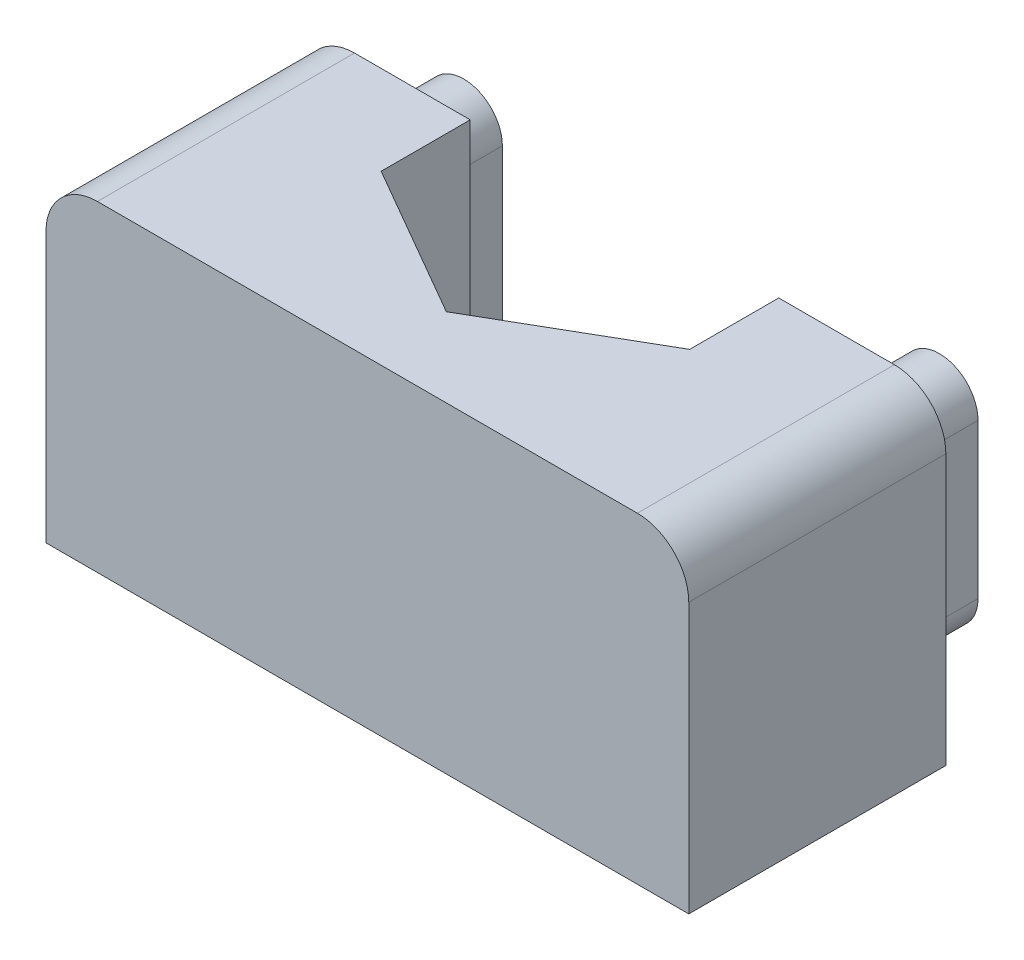
ISO-10303-21;
HEADER;
FILE_DESCRIPTION(('STEP AP214'),'2;1');
FILE_NAME('part.step','',(''),(''),'','','');
FILE_SCHEMA(('AUTOMOTIVE_DESIGN { 1 0 10303 214 1 1 1 1 }'));
ENDSEC;
DATA;
#1=APPLICATION_CONTEXT('core data for automotive mechanical design processes');
#2=APPLICATION_PROTOCOL_DEFINITION('international standard','automotive_design',2000,#1);
#3=PRODUCT_CONTEXT('',#1,'mechanical');
#4=PRODUCT('Part','Part','',(#3));
#5=PRODUCT_RELATED_PRODUCT_CATEGORY('part','',(#4));
#6=PRODUCT_DEFINITION_FORMATION('','',#4);
#7=PRODUCT_DEFINITION_CONTEXT('part definition',#1,'design');
#8=PRODUCT_DEFINITION('design','',#6,#7);
#9=PRODUCT_DEFINITION_SHAPE('','',#8);
#10=(LENGTH_UNIT() NAMED_UNIT(*) SI_UNIT(.MILLI.,.METRE.));
#11=(NAMED_UNIT(*) PLANE_ANGLE_UNIT() SI_UNIT($,.RADIAN.));
#12=(NAMED_UNIT(*) SI_UNIT($,.STERADIAN.) SOLID_ANGLE_UNIT());
#13=UNCERTAINTY_MEASURE_WITH_UNIT(LENGTH_MEASURE(1.E-05),#10,'distance_accuracy_value','');
#14=(GEOMETRIC_REPRESENTATION_CONTEXT(3) GLOBAL_UNCERTAINTY_ASSIGNED_CONTEXT((#13)) GLOBAL_UNIT_ASSIGNED_CONTEXT((#10,
#11,#12)) REPRESENTATION_CONTEXT('',''));
#15=CARTESIAN_POINT('',(0.,0.,0.));
#16=DIRECTION('',(0.,0.,1.));
#17=DIRECTION('',(1.,0.,0.));
#18=AXIS2_PLACEMENT_3D('',#15,#16,#17);
#19=CARTESIAN_POINT('',(-25.,-12.5,-39.));
#20=DIRECTION('',(0.,0.,-1.));
#21=DIRECTION('',(-1.,0.,0.));
#22=AXIS2_PLACEMENT_3D('',#19,#20,#21);
#23=PLANE('',#22);
#24=DIRECTION('',(0.,1.,0.));
#25=VECTOR('',#24,1.);
#26=CARTESIAN_POINT('',(-25.,-12.5,-39.));
#27=LINE('',#26,#25);
#28=CARTESIAN_POINT('',(-25.,-12.5,-39.));
#29=VERTEX_POINT('',#28);
#30=CARTESIAN_POINT('',(-25.,-2.,-39.));
#31=VERTEX_POINT('',#30);
#32=EDGE_CURVE('E300',#29,#31,#27,.T.);
#33=ORIENTED_EDGE('',*,*,#32,.T.);
#34=CARTESIAN_POINT('',(-23.,-2.,-39.));
#35=DIRECTION('',(0.,0.,-1.));
#36=DIRECTION('',(-1.,0.,0.));
#37=AXIS2_PLACEMENT_3D('',#34,#35,#36);
#38=CIRCLE('',#37,2.);
#39=CARTESIAN_POINT('',(-23.,0.,-39.));
#40=VERTEX_POINT('',#39);
#41=EDGE_CURVE('E11',#31,#40,#38,.T.);
#42=ORIENTED_EDGE('',*,*,#41,.T.);
#43=DIRECTION('',(-1.,0.,0.));
#44=VECTOR('',#43,1.);
#45=CARTESIAN_POINT('',(-25.,0.,-39.));
#46=LINE('',#45,#44);
#47=CARTESIAN_POINT('',(-18.5,0.,-39.));
#48=VERTEX_POINT('',#47);
#49=EDGE_CURVE('E298',#48,#40,#46,.T.);
#50=ORIENTED_EDGE('',*,*,#49,.F.);
#51=DIRECTION('',(0.,1.,0.));
#52=VECTOR('',#51,1.);
#53=CARTESIAN_POINT('',(-18.5,-7.5,-39.));
#54=LINE('',#53,#52);
#55=CARTESIAN_POINT('',(-18.5,-7.5,-39.));
#56=VERTEX_POINT('',#55);
#57=EDGE_CURVE('E266',#56,#48,#54,.T.);
#58=ORIENTED_EDGE('',*,*,#57,.F.);
#59=DIRECTION('',(-1.,0.,0.));
#60=VECTOR('',#59,1.);
#61=CARTESIAN_POINT('',(-25.,-7.5,-39.));
#62=LINE('',#61,#60);
#63=CARTESIAN_POINT('',(-17.5,-7.5,-39.));
#64=VERTEX_POINT('',#63);
#65=EDGE_CURVE('E309',#64,#56,#62,.T.);
#66=ORIENTED_EDGE('',*,*,#65,.F.);
#67=DIRECTION('',(0.,1.,0.));
#68=VECTOR('',#67,1.);
#69=CARTESIAN_POINT('',(-17.5,-12.5,-39.));
#70=LINE('',#69,#68);
#71=CARTESIAN_POINT('',(-17.5,-12.5,-39.));
#72=VERTEX_POINT('',#71);
#73=EDGE_CURVE('E250',#72,#64,#70,.T.);
#74=ORIENTED_EDGE('',*,*,#73,.F.);
#75=DIRECTION('',(-1.,0.,0.));
#76=VECTOR('',#75,1.);
#77=CARTESIAN_POINT('',(-25.,-12.5,-39.));
#78=LINE('',#77,#76);
#79=EDGE_CURVE('E290',#72,#29,#78,.T.);
#80=ORIENTED_EDGE('',*,*,#79,.T.);
#81=EDGE_LOOP('',(#33,#42,#50,#58,#66,#74,#80));
#82=FACE_BOUND('',#81,.T.);
#83=DIRECTION('',(0.,-1.,0.));
#84=VECTOR('',#83,1.);
#85=CARTESIAN_POINT('',(-20.25,-3.25,-39.));
#86=LINE('',#85,#84);
#87=CARTESIAN_POINT('',(-20.25,-3.25,-39.));
#88=VERTEX_POINT('',#87);
#89=CARTESIAN_POINT('',(-20.25,-9.25,-39.));
#90=VERTEX_POINT('',#89);
#91=EDGE_CURVE('E608',#88,#90,#86,.T.);
#92=ORIENTED_EDGE('',*,*,#91,.F.);
#93=CARTESIAN_POINT('',(-21.75,-3.25,-39.));
#94=DIRECTION('',(0.,0.,-1.));
#95=DIRECTION('',(1.,0.,0.));
#96=AXIS2_PLACEMENT_3D('',#93,#94,#95);
#97=CIRCLE('',#96,1.5);
#98=CARTESIAN_POINT('',(-23.25,-3.25,-39.));
#99=VERTEX_POINT('',#98);
#100=EDGE_CURVE('E204',#99,#88,#97,.T.);
#101=ORIENTED_EDGE('',*,*,#100,.F.);
#102=DIRECTION('',(0.,1.,0.));
#103=VECTOR('',#102,1.);
#104=CARTESIAN_POINT('',(-23.25,-3.25,-39.));
#105=LINE('',#104,#103);
#106=CARTESIAN_POINT('',(-23.25,-9.25,-39.));
#107=VERTEX_POINT('',#106);
#108=EDGE_CURVE('E200',#107,#99,#105,.T.);
#109=ORIENTED_EDGE('',*,*,#108,.F.);
#110=CARTESIAN_POINT('',(-21.75,-9.25,-39.));
#111=DIRECTION('',(0.,0.,-1.));
#112=DIRECTION('',(1.,0.,0.));
#113=AXIS2_PLACEMENT_3D('',#110,#111,#112);
#114=CIRCLE('',#113,1.5);
#115=EDGE_CURVE('E605',#90,#107,#114,.T.);
#116=ORIENTED_EDGE('',*,*,#115,.F.);
#117=EDGE_LOOP('',(#92,#101,#109,#116));
#118=FACE_BOUND('',#117,.T.);
#119=ADVANCED_FACE('F39',(#82,#118),#23,.T.);
#120=CARTESIAN_POINT('',(-2.00000000000002,0.,-39.));
#121=VERTEX_POINT('',#120);
#122=CARTESIAN_POINT('',(-6.5,0.,-39.));
#123=VERTEX_POINT('',#122);
#124=EDGE_CURVE('E291',#121,#123,#46,.T.);
#125=ORIENTED_EDGE('',*,*,#124,.F.);
#126=CARTESIAN_POINT('',(-2.00000000000001,-2.,-39.));
#127=DIRECTION('',(0.,0.,-1.));
#128=DIRECTION('',(-1.,0.,0.));
#129=AXIS2_PLACEMENT_3D('',#126,#127,#128);
#130=CIRCLE('',#129,2.);
#131=CARTESIAN_POINT('',(0.,-2.,-39.));
#132=VERTEX_POINT('',#131);
#133=EDGE_CURVE('E322',#121,#132,#130,.T.);
#134=ORIENTED_EDGE('',*,*,#133,.T.);
#135=DIRECTION('',(0.,1.,0.));
#136=VECTOR('',#135,1.);
#137=CARTESIAN_POINT('',(0.,-12.5,-39.));
#138=LINE('',#137,#136);
#139=CARTESIAN_POINT('',(0.,-12.5,-39.));
#140=VERTEX_POINT('',#139);
#141=EDGE_CURVE('E303',#140,#132,#138,.T.);
#142=ORIENTED_EDGE('',*,*,#141,.F.);
#143=CARTESIAN_POINT('',(-7.5,-12.5,-39.));
#144=VERTEX_POINT('',#143);
#145=EDGE_CURVE('E292',#140,#144,#78,.T.);
#146=ORIENTED_EDGE('',*,*,#145,.T.);
#147=DIRECTION('',(0.,1.,0.));
#148=VECTOR('',#147,1.);
#149=CARTESIAN_POINT('',(-7.5,-12.5,-39.));
#150=LINE('',#149,#148);
#151=CARTESIAN_POINT('',(-7.5,-7.5,-39.));
#152=VERTEX_POINT('',#151);
#153=EDGE_CURVE('E248',#152,#144,#150,.F.);
#154=ORIENTED_EDGE('',*,*,#153,.F.);
#155=CARTESIAN_POINT('',(-6.5,-7.5,-39.));
#156=VERTEX_POINT('',#155);
#157=EDGE_CURVE('E310',#156,#152,#62,.T.);
#158=ORIENTED_EDGE('',*,*,#157,.F.);
#159=DIRECTION('',(0.,-1.,0.));
#160=VECTOR('',#159,1.);
#161=CARTESIAN_POINT('',(-6.5,-12.5,-39.));
#162=LINE('',#161,#160);
#163=EDGE_CURVE('E279',#123,#156,#162,.T.);
#164=ORIENTED_EDGE('',*,*,#163,.F.);
#165=EDGE_LOOP('',(#125,#134,#142,#146,#154,#158,#164));
#166=FACE_BOUND('',#165,.T.);
#167=DIRECTION('',(0.,-1.,0.));
#168=VECTOR('',#167,1.);
#169=CARTESIAN_POINT('',(-1.75,-3.25,-39.));
#170=LINE('',#169,#168);
#171=CARTESIAN_POINT('',(-1.75,-3.25,-39.));
#172=VERTEX_POINT('',#171);
#173=CARTESIAN_POINT('',(-1.75,-9.25,-39.));
#174=VERTEX_POINT('',#173);
#175=EDGE_CURVE('E209',#172,#174,#170,.T.);
#176=ORIENTED_EDGE('',*,*,#175,.F.);
#177=CARTESIAN_POINT('',(-3.25,-3.25,-39.));
#178=DIRECTION('',(0.,0.,-1.));
#179=DIRECTION('',(-1.,0.,0.));
#180=AXIS2_PLACEMENT_3D('',#177,#178,#179);
#181=CIRCLE('',#180,1.5);
#182=CARTESIAN_POINT('',(-4.75,-3.25,-39.));
#183=VERTEX_POINT('',#182);
#184=EDGE_CURVE('E206',#183,#172,#181,.T.);
#185=ORIENTED_EDGE('',*,*,#184,.F.);
#186=DIRECTION('',(0.,1.,0.));
#187=VECTOR('',#186,1.);
#188=CARTESIAN_POINT('',(-4.75,-3.25,-39.));
#189=LINE('',#188,#187);
#190=CARTESIAN_POINT('',(-4.75,-9.25,-39.));
#191=VERTEX_POINT('',#190);
#192=EDGE_CURVE('E219',#191,#183,#189,.T.);
#193=ORIENTED_EDGE('',*,*,#192,.F.);
#194=CARTESIAN_POINT('',(-3.25,-9.25,-39.));
#195=DIRECTION('',(0.,0.,-1.));
#196=DIRECTION('',(-1.,0.,0.));
#197=AXIS2_PLACEMENT_3D('',#194,#195,#196);
#198=CIRCLE('',#197,1.5);
#199=EDGE_CURVE('E227',#174,#191,#198,.T.);
#200=ORIENTED_EDGE('',*,*,#199,.F.);
#201=EDGE_LOOP('',(#176,#185,#193,#200));
#202=FACE_BOUND('',#201,.T.);
#203=ADVANCED_FACE('F343',(#166,#202),#23,.T.);
#204=CARTESIAN_POINT('',(0.,-12.5,0.));
#205=DIRECTION('',(-1.,0.,0.));
#206=DIRECTION('',(0.,0.,1.));
#207=AXIS2_PLACEMENT_3D('',#204,#205,#206);
#208=PLANE('',#207);
#209=ORIENTED_EDGE('',*,*,#141,.T.);
#210=DIRECTION('',(0.,0.,-1.));
#211=VECTOR('',#210,1.);
#212=CARTESIAN_POINT('',(0.,-2.,-29.));
#213=LINE('',#212,#211);
#214=CARTESIAN_POINT('',(0.,-2.,-29.));
#215=VERTEX_POINT('',#214);
#216=EDGE_CURVE('E324',#132,#215,#213,.F.);
#217=ORIENTED_EDGE('',*,*,#216,.T.);
#218=DIRECTION('',(0.,-1.,0.));
#219=VECTOR('',#218,1.);
#220=CARTESIAN_POINT('',(0.,-12.5,-29.));
#221=LINE('',#220,#219);
#222=CARTESIAN_POINT('',(0.,-12.5,-29.));
#223=VERTEX_POINT('',#222);
#224=EDGE_CURVE('E243',#215,#223,#221,.T.);
#225=ORIENTED_EDGE('',*,*,#224,.T.);
#226=DIRECTION('',(0.,0.,1.));
#227=VECTOR('',#226,1.);
#228=CARTESIAN_POINT('',(0.,-12.5,0.));
#229=LINE('',#228,#227);
#230=EDGE_CURVE('E302',#140,#223,#229,.T.);
#231=ORIENTED_EDGE('',*,*,#230,.F.);
#232=EDGE_LOOP('',(#209,#217,#225,#231));
#233=FACE_BOUND('',#232,.T.);
#234=ADVANCED_FACE('F348',(#233),#208,.F.);
#235=CARTESIAN_POINT('',(0.,-12.5,0.));
#236=DIRECTION('',(0.,1.,0.));
#237=DIRECTION('',(0.,0.,1.));
#238=AXIS2_PLACEMENT_3D('',#235,#236,#237);
#239=PLANE('',#238);
#240=ORIENTED_EDGE('',*,*,#230,.T.);
#241=DIRECTION('',(-1.,0.,0.));
#242=VECTOR('',#241,1.);
#243=CARTESIAN_POINT('',(-63.,-12.5,-29.));
#244=LINE('',#243,#242);
#245=CARTESIAN_POINT('',(-25.,-12.5,-29.));
#246=VERTEX_POINT('',#245);
#247=EDGE_CURVE('E240',#223,#246,#244,.T.);
#248=ORIENTED_EDGE('',*,*,#247,.T.);
#249=DIRECTION('',(0.,0.,1.));
#250=VECTOR('',#249,1.);
#251=CARTESIAN_POINT('',(-25.,-12.5,-39.));
#252=LINE('',#251,#250);
#253=EDGE_CURVE('E287',#29,#246,#252,.T.);
#254=ORIENTED_EDGE('',*,*,#253,.F.);
#255=ORIENTED_EDGE('',*,*,#79,.F.);
#256=CARTESIAN_POINT('',(-12.5,-12.5,-39.));
#257=DIRECTION('',(0.,1.,0.));
#258=DIRECTION('',(0.,0.,1.));
#259=AXIS2_PLACEMENT_3D('',#256,#257,#258);
#260=CIRCLE('',#259,5.);
#261=EDGE_CURVE('E245',#72,#144,#260,.T.);
#262=ORIENTED_EDGE('',*,*,#261,.T.);
#263=ORIENTED_EDGE('',*,*,#145,.F.);
#264=EDGE_LOOP('',(#240,#248,#254,#255,#262,#263));
#265=FACE_BOUND('',#264,.T.);
#266=ADVANCED_FACE('F350',(#265),#239,.F.);
#267=CARTESIAN_POINT('',(-25.,-12.5,-39.));
#268=DIRECTION('',(-1.,0.,0.));
#269=DIRECTION('',(0.,0.,1.));
#270=AXIS2_PLACEMENT_3D('',#267,#268,#269);
#271=PLANE('',#270);
#272=DIRECTION('',(0.,1.,0.));
#273=VECTOR('',#272,1.);
#274=CARTESIAN_POINT('',(-25.,-12.5,-29.));
#275=LINE('',#274,#273);
#276=CARTESIAN_POINT('',(-25.,-2.,-29.));
#277=VERTEX_POINT('',#276);
#278=EDGE_CURVE('E295',#246,#277,#275,.T.);
#279=ORIENTED_EDGE('',*,*,#278,.T.);
#280=DIRECTION('',(0.,0.,1.));
#281=VECTOR('',#280,1.);
#282=CARTESIAN_POINT('',(-25.,-2.,-39.));
#283=LINE('',#282,#281);
#284=EDGE_CURVE('E47',#277,#31,#283,.F.);
#285=ORIENTED_EDGE('',*,*,#284,.T.);
#286=ORIENTED_EDGE('',*,*,#32,.F.);
#287=ORIENTED_EDGE('',*,*,#253,.T.);
#288=EDGE_LOOP('',(#279,#285,#286,#287));
#289=FACE_BOUND('',#288,.T.);
#290=ADVANCED_FACE('F393',(#289),#271,.T.);
#291=CARTESIAN_POINT('',(0.,0.,0.));
#292=DIRECTION('',(0.,1.,0.));
#293=DIRECTION('',(0.,0.,1.));
#294=AXIS2_PLACEMENT_3D('',#291,#292,#293);
#295=PLANE('',#294);
#296=DIRECTION('',(1.,0.,0.));
#297=VECTOR('',#296,1.);
#298=CARTESIAN_POINT('',(-25.,0.,-29.));
#299=LINE('',#298,#297);
#300=CARTESIAN_POINT('',(-23.,0.,-29.));
#301=VERTEX_POINT('',#300);
#302=CARTESIAN_POINT('',(-2.00000000000001,0.,-29.));
#303=VERTEX_POINT('',#302);
#304=EDGE_CURVE('E286',#301,#303,#299,.T.);
#305=ORIENTED_EDGE('',*,*,#304,.T.);
#306=DIRECTION('',(0.,0.,-1.));
#307=VECTOR('',#306,1.);
#308=CARTESIAN_POINT('',(-2.00000000000001,0.,-39.));
#309=LINE('',#308,#307);
#310=EDGE_CURVE('E319',#303,#121,#309,.T.);
#311=ORIENTED_EDGE('',*,*,#310,.T.);
#312=ORIENTED_EDGE('',*,*,#124,.T.);
#313=DIRECTION('',(0.,0.,-1.));
#314=VECTOR('',#313,1.);
#315=CARTESIAN_POINT('',(-6.5,0.,-35.5358983848623));
#316=LINE('',#315,#314);
#317=CARTESIAN_POINT('',(-6.5,0.,-35.5358983848623));
#318=VERTEX_POINT('',#317);
#319=EDGE_CURVE('E252',#318,#123,#316,.T.);
#320=ORIENTED_EDGE('',*,*,#319,.F.);
#321=DIRECTION('',(0.866025403784437,0.,-0.500000000000004));
#322=VECTOR('',#321,1.);
#323=CARTESIAN_POINT('',(-12.5,0.,-32.0717967697245));
#324=LINE('',#323,#322);
#325=CARTESIAN_POINT('',(-12.5,0.,-32.0717967697245));
#326=VERTEX_POINT('',#325);
#327=EDGE_CURVE('E257',#326,#318,#324,.T.);
#328=ORIENTED_EDGE('',*,*,#327,.F.);
#329=DIRECTION('',(0.866025403784439,0.,0.5));
#330=VECTOR('',#329,1.);
#331=CARTESIAN_POINT('',(-18.5,0.,-35.5358983848623));
#332=LINE('',#331,#330);
#333=CARTESIAN_POINT('',(-18.5,0.,-35.5358983848623));
#334=VERTEX_POINT('',#333);
#335=EDGE_CURVE('E272',#334,#326,#332,.T.);
#336=ORIENTED_EDGE('',*,*,#335,.F.);
#337=DIRECTION('',(0.,0.,1.));
#338=VECTOR('',#337,1.);
#339=CARTESIAN_POINT('',(-18.5,0.,-35.5358983848623));
#340=LINE('',#339,#338);
#341=EDGE_CURVE('E269',#48,#334,#340,.T.);
#342=ORIENTED_EDGE('',*,*,#341,.F.);
#343=ORIENTED_EDGE('',*,*,#49,.T.);
#344=DIRECTION('',(0.,0.,1.));
#345=VECTOR('',#344,1.);
#346=CARTESIAN_POINT('',(-23.,0.,0.));
#347=LINE('',#346,#345);
#348=EDGE_CURVE('E316',#40,#301,#347,.T.);
#349=ORIENTED_EDGE('',*,*,#348,.T.);
#350=EDGE_LOOP('',(#305,#311,#312,#320,#328,#336,#342,#343,#349));
#351=FACE_BOUND('',#350,.T.);
#352=ADVANCED_FACE('F336',(#351),#295,.T.);
#353=CARTESIAN_POINT('',(-6.5,-7.5,-35.5358983848623));
#354=DIRECTION('',(1.,0.,0.));
#355=DIRECTION('',(0.,0.,-1.));
#356=AXIS2_PLACEMENT_3D('',#353,#354,#355);
#357=PLANE('',#356);
#358=ORIENTED_EDGE('',*,*,#163,.T.);
#359=DIRECTION('',(0.,0.,-1.));
#360=VECTOR('',#359,1.);
#361=CARTESIAN_POINT('',(-6.5,-7.5,-35.5358983848623));
#362=LINE('',#361,#360);
#363=CARTESIAN_POINT('',(-6.5,-7.5,-35.5358983848623));
#364=VERTEX_POINT('',#363);
#365=EDGE_CURVE('E253',#364,#156,#362,.T.);
#366=ORIENTED_EDGE('',*,*,#365,.F.);
#367=DIRECTION('',(0.,1.,0.));
#368=VECTOR('',#367,1.);
#369=CARTESIAN_POINT('',(-6.5,-7.5,-35.5358983848623));
#370=LINE('',#369,#368);
#371=EDGE_CURVE('E277',#364,#318,#370,.T.);
#372=ORIENTED_EDGE('',*,*,#371,.T.);
#373=ORIENTED_EDGE('',*,*,#319,.T.);
#374=EDGE_LOOP('',(#358,#366,#372,#373));
#375=FACE_BOUND('',#374,.T.);
#376=ADVANCED_FACE('F362',(#375),#357,.F.);
#377=CARTESIAN_POINT('',(-12.5,-7.5,-32.0717967697245));
#378=DIRECTION('',(0.500000000000004,0.,0.866025403784436));
#379=DIRECTION('',(0.866025403784436,0.,-0.500000000000004));
#380=AXIS2_PLACEMENT_3D('',#377,#378,#379);
#381=PLANE('',#380);
#382=ORIENTED_EDGE('',*,*,#327,.T.);
#383=ORIENTED_EDGE('',*,*,#371,.F.);
#384=DIRECTION('',(0.866025403784437,0.,-0.500000000000004));
#385=VECTOR('',#384,1.);
#386=CARTESIAN_POINT('',(-12.5,-7.5,-32.0717967697245));
#387=LINE('',#386,#385);
#388=CARTESIAN_POINT('',(-12.5,-7.5,-32.0717967697245));
#389=VERTEX_POINT('',#388);
#390=EDGE_CURVE('E263',#389,#364,#387,.T.);
#391=ORIENTED_EDGE('',*,*,#390,.F.);
#392=DIRECTION('',(0.,1.,0.));
#393=VECTOR('',#392,1.);
#394=CARTESIAN_POINT('',(-12.5,-7.5,-32.0717967697245));
#395=LINE('',#394,#393);
#396=EDGE_CURVE('E280',#389,#326,#395,.T.);
#397=ORIENTED_EDGE('',*,*,#396,.T.);
#398=EDGE_LOOP('',(#382,#383,#391,#397));
#399=FACE_BOUND('',#398,.T.);
#400=ADVANCED_FACE('F368',(#399),#381,.F.);
#401=CARTESIAN_POINT('',(-18.5,-7.5,-35.5358983848623));
#402=DIRECTION('',(-0.5,0.,0.866025403784439));
#403=DIRECTION('',(0.866025403784439,0.,0.5));
#404=AXIS2_PLACEMENT_3D('',#401,#402,#403);
#405=PLANE('',#404);
#406=ORIENTED_EDGE('',*,*,#335,.T.);
#407=ORIENTED_EDGE('',*,*,#396,.F.);
#408=DIRECTION('',(0.866025403784439,0.,0.5));
#409=VECTOR('',#408,1.);
#410=CARTESIAN_POINT('',(-18.5,-7.5,-35.5358983848623));
#411=LINE('',#410,#409);
#412=CARTESIAN_POINT('',(-18.5,-7.5,-35.5358983848623));
#413=VERTEX_POINT('',#412);
#414=EDGE_CURVE('E260',#413,#389,#411,.T.);
#415=ORIENTED_EDGE('',*,*,#414,.F.);
#416=DIRECTION('',(0.,1.,0.));
#417=VECTOR('',#416,1.);
#418=CARTESIAN_POINT('',(-18.5,-7.5,-35.5358983848623));
#419=LINE('',#418,#417);
#420=EDGE_CURVE('E282',#413,#334,#419,.T.);
#421=ORIENTED_EDGE('',*,*,#420,.T.);
#422=EDGE_LOOP('',(#406,#407,#415,#421));
#423=FACE_BOUND('',#422,.T.);
#424=ADVANCED_FACE('F371',(#423),#405,.F.);
#425=CARTESIAN_POINT('',(-18.5,-7.5,-35.5358983848623));
#426=DIRECTION('',(-1.,0.,0.));
#427=DIRECTION('',(0.,0.,1.));
#428=AXIS2_PLACEMENT_3D('',#425,#426,#427);
#429=PLANE('',#428);
#430=ORIENTED_EDGE('',*,*,#341,.T.);
#431=ORIENTED_EDGE('',*,*,#420,.F.);
#432=DIRECTION('',(0.,0.,1.));
#433=VECTOR('',#432,1.);
#434=CARTESIAN_POINT('',(-18.5,-7.5,-35.5358983848623));
#435=LINE('',#434,#433);
#436=EDGE_CURVE('E256',#56,#413,#435,.T.);
#437=ORIENTED_EDGE('',*,*,#436,.F.);
#438=ORIENTED_EDGE('',*,*,#57,.T.);
#439=EDGE_LOOP('',(#430,#431,#437,#438));
#440=FACE_BOUND('',#439,.T.);
#441=ADVANCED_FACE('F374',(#440),#429,.F.);
#442=CARTESIAN_POINT('',(0.,-7.5,0.));
#443=DIRECTION('',(0.,-1.,0.));
#444=DIRECTION('',(0.,0.,-1.));
#445=AXIS2_PLACEMENT_3D('',#442,#443,#444);
#446=PLANE('',#445);
#447=ORIENTED_EDGE('',*,*,#157,.T.);
#448=CARTESIAN_POINT('',(-12.5,-7.5,-39.));
#449=DIRECTION('',(0.,-1.,0.));
#450=DIRECTION('',(0.,0.,-1.));
#451=AXIS2_PLACEMENT_3D('',#448,#449,#450);
#452=CIRCLE('',#451,5.);
#453=EDGE_CURVE('E313',#152,#64,#452,.T.);
#454=ORIENTED_EDGE('',*,*,#453,.T.);
#455=ORIENTED_EDGE('',*,*,#65,.T.);
#456=ORIENTED_EDGE('',*,*,#436,.T.);
#457=ORIENTED_EDGE('',*,*,#414,.T.);
#458=ORIENTED_EDGE('',*,*,#390,.T.);
#459=ORIENTED_EDGE('',*,*,#365,.T.);
#460=EDGE_LOOP('',(#447,#454,#455,#456,#457,#458,#459));
#461=FACE_BOUND('',#460,.T.);
#462=ADVANCED_FACE('F357',(#461),#446,.F.);
#463=CARTESIAN_POINT('',(-12.5,-12.5,-39.));
#464=DIRECTION('',(0.,1.,0.));
#465=DIRECTION('',(0.,0.,1.));
#466=AXIS2_PLACEMENT_3D('',#463,#464,#465);
#467=CYLINDRICAL_SURFACE('',#466,5.);
#468=ORIENTED_EDGE('',*,*,#73,.T.);
#469=ORIENTED_EDGE('',*,*,#453,.F.);
#470=ORIENTED_EDGE('',*,*,#153,.T.);
#471=ORIENTED_EDGE('',*,*,#261,.F.);
#472=EDGE_LOOP('',(#468,#469,#470,#471));
#473=FACE_BOUND('',#472,.T.);
#474=ADVANCED_FACE('F448',(#473),#467,.F.);
#475=CARTESIAN_POINT('',(-63.,-12.5,-29.));
#476=DIRECTION('',(0.,0.,-1.));
#477=DIRECTION('',(-1.,0.,0.));
#478=AXIS2_PLACEMENT_3D('',#475,#476,#477);
#479=PLANE('',#478);
#480=ORIENTED_EDGE('',*,*,#224,.F.);
#481=CARTESIAN_POINT('',(-2.00000000000001,-2.,-29.));
#482=DIRECTION('',(0.,0.,-1.));
#483=DIRECTION('',(-1.,0.,0.));
#484=AXIS2_PLACEMENT_3D('',#481,#482,#483);
#485=CIRCLE('',#484,2.);
#486=EDGE_CURVE('E327',#215,#303,#485,.F.);
#487=ORIENTED_EDGE('',*,*,#486,.T.);
#488=ORIENTED_EDGE('',*,*,#304,.F.);
#489=CARTESIAN_POINT('',(-23.,-2.,-29.));
#490=DIRECTION('',(0.,0.,-1.));
#491=DIRECTION('',(-1.,0.,0.));
#492=AXIS2_PLACEMENT_3D('',#489,#490,#491);
#493=CIRCLE('',#492,2.);
#494=EDGE_CURVE('E61',#301,#277,#493,.F.);
#495=ORIENTED_EDGE('',*,*,#494,.T.);
#496=ORIENTED_EDGE('',*,*,#278,.F.);
#497=ORIENTED_EDGE('',*,*,#247,.F.);
#498=EDGE_LOOP('',(#480,#487,#488,#495,#496,#497));
#499=FACE_BOUND('',#498,.T.);
#500=ADVANCED_FACE('F330',(#499),#479,.F.);
#501=CARTESIAN_POINT('',(-3.25,-3.25,-42.));
#502=DIRECTION('',(0.,0.,1.));
#503=DIRECTION('',(1.,0.,0.));
#504=AXIS2_PLACEMENT_3D('',#501,#502,#503);
#505=CYLINDRICAL_SURFACE('',#504,1.5);
#506=ORIENTED_EDGE('',*,*,#184,.T.);
#507=DIRECTION('',(0.,0.,1.));
#508=VECTOR('',#507,1.);
#509=CARTESIAN_POINT('',(-1.75,-3.25,-42.));
#510=LINE('',#509,#508);
#511=CARTESIAN_POINT('',(-1.75,-3.25,-42.));
#512=VERTEX_POINT('',#511);
#513=EDGE_CURVE('E238',#512,#172,#510,.T.);
#514=ORIENTED_EDGE('',*,*,#513,.F.);
#515=CARTESIAN_POINT('',(-3.25,-3.25,-42.));
#516=DIRECTION('',(0.,0.,-1.));
#517=DIRECTION('',(-1.,0.,0.));
#518=AXIS2_PLACEMENT_3D('',#515,#516,#517);
#519=CIRCLE('',#518,1.5);
#520=CARTESIAN_POINT('',(-4.75,-3.25,-42.));
#521=VERTEX_POINT('',#520);
#522=EDGE_CURVE('E215',#521,#512,#519,.T.);
#523=ORIENTED_EDGE('',*,*,#522,.F.);
#524=DIRECTION('',(0.,0.,1.));
#525=VECTOR('',#524,1.);
#526=CARTESIAN_POINT('',(-4.75,-3.25,-42.));
#527=LINE('',#526,#525);
#528=EDGE_CURVE('E224',#521,#183,#527,.T.);
#529=ORIENTED_EDGE('',*,*,#528,.T.);
#530=EDGE_LOOP('',(#506,#514,#523,#529));
#531=FACE_BOUND('',#530,.T.);
#532=ADVANCED_FACE('F459',(#531),#505,.T.);
#533=CARTESIAN_POINT('',(-1.75,-3.25,-42.));
#534=DIRECTION('',(-1.,0.,0.));
#535=DIRECTION('',(0.,-1.,0.));
#536=AXIS2_PLACEMENT_3D('',#533,#534,#535);
#537=PLANE('',#536);
#538=ORIENTED_EDGE('',*,*,#175,.T.);
#539=DIRECTION('',(0.,0.,1.));
#540=VECTOR('',#539,1.);
#541=CARTESIAN_POINT('',(-1.75,-9.25,-42.));
#542=LINE('',#541,#540);
#543=CARTESIAN_POINT('',(-1.75,-9.25,-42.));
#544=VERTEX_POINT('',#543);
#545=EDGE_CURVE('E235',#544,#174,#542,.T.);
#546=ORIENTED_EDGE('',*,*,#545,.F.);
#547=DIRECTION('',(0.,-1.,0.));
#548=VECTOR('',#547,1.);
#549=CARTESIAN_POINT('',(-1.75,-3.25,-42.));
#550=LINE('',#549,#548);
#551=EDGE_CURVE('E218',#512,#544,#550,.T.);
#552=ORIENTED_EDGE('',*,*,#551,.F.);
#553=ORIENTED_EDGE('',*,*,#513,.T.);
#554=EDGE_LOOP('',(#538,#546,#552,#553));
#555=FACE_BOUND('',#554,.T.);
#556=ADVANCED_FACE('F466',(#555),#537,.F.);
#557=CARTESIAN_POINT('',(-3.25,-9.25,-42.));
#558=DIRECTION('',(0.,0.,1.));
#559=DIRECTION('',(1.,0.,0.));
#560=AXIS2_PLACEMENT_3D('',#557,#558,#559);
#561=CYLINDRICAL_SURFACE('',#560,1.5);
#562=ORIENTED_EDGE('',*,*,#199,.T.);
#563=DIRECTION('',(0.,0.,1.));
#564=VECTOR('',#563,1.);
#565=CARTESIAN_POINT('',(-4.75,-9.25,-42.));
#566=LINE('',#565,#564);
#567=CARTESIAN_POINT('',(-4.75,-9.25,-42.));
#568=VERTEX_POINT('',#567);
#569=EDGE_CURVE('E233',#568,#191,#566,.T.);
#570=ORIENTED_EDGE('',*,*,#569,.F.);
#571=CARTESIAN_POINT('',(-3.25,-9.25,-42.));
#572=DIRECTION('',(0.,0.,-1.));
#573=DIRECTION('',(-1.,0.,0.));
#574=AXIS2_PLACEMENT_3D('',#571,#572,#573);
#575=CIRCLE('',#574,1.5);
#576=EDGE_CURVE('E221',#544,#568,#575,.T.);
#577=ORIENTED_EDGE('',*,*,#576,.F.);
#578=ORIENTED_EDGE('',*,*,#545,.T.);
#579=EDGE_LOOP('',(#562,#570,#577,#578));
#580=FACE_BOUND('',#579,.T.);
#581=ADVANCED_FACE('F474',(#580),#561,.T.);
#582=CARTESIAN_POINT('',(-4.75,-3.25,-42.));
#583=DIRECTION('',(1.,0.,0.));
#584=DIRECTION('',(0.,1.,0.));
#585=AXIS2_PLACEMENT_3D('',#582,#583,#584);
#586=PLANE('',#585);
#587=ORIENTED_EDGE('',*,*,#192,.T.);
#588=ORIENTED_EDGE('',*,*,#528,.F.);
#589=DIRECTION('',(0.,1.,0.));
#590=VECTOR('',#589,1.);
#591=CARTESIAN_POINT('',(-4.75,-3.25,-42.));
#592=LINE('',#591,#590);
#593=EDGE_CURVE('E223',#568,#521,#592,.T.);
#594=ORIENTED_EDGE('',*,*,#593,.F.);
#595=ORIENTED_EDGE('',*,*,#569,.T.);
#596=EDGE_LOOP('',(#587,#588,#594,#595));
#597=FACE_BOUND('',#596,.T.);
#598=ADVANCED_FACE('F482',(#597),#586,.F.);
#599=CARTESIAN_POINT('',(-3.25,-3.25,-42.));
#600=DIRECTION('',(0.,0.,-1.));
#601=DIRECTION('',(-1.,0.,0.));
#602=AXIS2_PLACEMENT_3D('',#599,#600,#601);
#603=PLANE('',#602);
#604=ORIENTED_EDGE('',*,*,#522,.T.);
#605=ORIENTED_EDGE('',*,*,#551,.T.);
#606=ORIENTED_EDGE('',*,*,#576,.T.);
#607=ORIENTED_EDGE('',*,*,#593,.T.);
#608=EDGE_LOOP('',(#604,#605,#606,#607));
#609=FACE_BOUND('',#608,.T.);
#610=ADVANCED_FACE('F490',(#609),#603,.T.);
#611=CARTESIAN_POINT('',(-21.75,-3.25,-42.));
#612=DIRECTION('',(0.,0.,1.));
#613=DIRECTION('',(1.,0.,0.));
#614=AXIS2_PLACEMENT_3D('',#611,#612,#613);
#615=CYLINDRICAL_SURFACE('',#614,1.5);
#616=ORIENTED_EDGE('',*,*,#100,.T.);
#617=DIRECTION('',(0.,0.,1.));
#618=VECTOR('',#617,1.);
#619=CARTESIAN_POINT('',(-20.25,-3.25,-42.));
#620=LINE('',#619,#618);
#621=CARTESIAN_POINT('',(-20.25,-3.25,-42.));
#622=VERTEX_POINT('',#621);
#623=EDGE_CURVE('E184',#622,#88,#620,.T.);
#624=ORIENTED_EDGE('',*,*,#623,.F.);
#625=CARTESIAN_POINT('',(-21.75,-3.25,-42.));
#626=DIRECTION('',(0.,0.,-1.));
#627=DIRECTION('',(1.,0.,0.));
#628=AXIS2_PLACEMENT_3D('',#625,#626,#627);
#629=CIRCLE('',#628,1.5);
#630=CARTESIAN_POINT('',(-23.25,-3.25,-42.));
#631=VERTEX_POINT('',#630);
#632=EDGE_CURVE('E191',#631,#622,#629,.T.);
#633=ORIENTED_EDGE('',*,*,#632,.F.);
#634=DIRECTION('',(0.,0.,1.));
#635=VECTOR('',#634,1.);
#636=CARTESIAN_POINT('',(-23.25,-3.25,-42.));
#637=LINE('',#636,#635);
#638=EDGE_CURVE('E601',#631,#99,#637,.T.);
#639=ORIENTED_EDGE('',*,*,#638,.T.);
#640=EDGE_LOOP('',(#616,#624,#633,#639));
#641=FACE_BOUND('',#640,.T.);
#642=ADVANCED_FACE('F202',(#641),#615,.T.);
#643=CARTESIAN_POINT('',(-20.25,-3.25,-42.));
#644=DIRECTION('',(-1.,0.,0.));
#645=DIRECTION('',(0.,0.,1.));
#646=AXIS2_PLACEMENT_3D('',#643,#644,#645);
#647=PLANE('',#646);
#648=ORIENTED_EDGE('',*,*,#91,.T.);
#649=DIRECTION('',(0.,0.,1.));
#650=VECTOR('',#649,1.);
#651=CARTESIAN_POINT('',(-20.25,-9.25,-42.));
#652=LINE('',#651,#650);
#653=CARTESIAN_POINT('',(-20.25,-9.25,-42.));
#654=VERTEX_POINT('',#653);
#655=EDGE_CURVE('E187',#654,#90,#652,.T.);
#656=ORIENTED_EDGE('',*,*,#655,.F.);
#657=DIRECTION('',(0.,-1.,0.));
#658=VECTOR('',#657,1.);
#659=CARTESIAN_POINT('',(-20.25,-3.25,-42.));
#660=LINE('',#659,#658);
#661=EDGE_CURVE('E180',#622,#654,#660,.T.);
#662=ORIENTED_EDGE('',*,*,#661,.F.);
#663=ORIENTED_EDGE('',*,*,#623,.T.);
#664=EDGE_LOOP('',(#648,#656,#662,#663));
#665=FACE_BOUND('',#664,.T.);
#666=ADVANCED_FACE('F182',(#665),#647,.F.);
#667=CARTESIAN_POINT('',(-21.75,-9.25,-42.));
#668=DIRECTION('',(0.,0.,1.));
#669=DIRECTION('',(1.,0.,0.));
#670=AXIS2_PLACEMENT_3D('',#667,#668,#669);
#671=CYLINDRICAL_SURFACE('',#670,1.5);
#672=ORIENTED_EDGE('',*,*,#115,.T.);
#673=DIRECTION('',(0.,0.,1.));
#674=VECTOR('',#673,1.);
#675=CARTESIAN_POINT('',(-23.25,-9.25,-42.));
#676=LINE('',#675,#674);
#677=CARTESIAN_POINT('',(-23.25,-9.25,-42.));
#678=VERTEX_POINT('',#677);
#679=EDGE_CURVE('E211',#678,#107,#676,.T.);
#680=ORIENTED_EDGE('',*,*,#679,.F.);
#681=CARTESIAN_POINT('',(-21.75,-9.25,-42.));
#682=DIRECTION('',(0.,0.,-1.));
#683=DIRECTION('',(1.,0.,0.));
#684=AXIS2_PLACEMENT_3D('',#681,#682,#683);
#685=CIRCLE('',#684,1.5);
#686=EDGE_CURVE('E190',#654,#678,#685,.T.);
#687=ORIENTED_EDGE('',*,*,#686,.F.);
#688=ORIENTED_EDGE('',*,*,#655,.T.);
#689=EDGE_LOOP('',(#672,#680,#687,#688));
#690=FACE_BOUND('',#689,.T.);
#691=ADVANCED_FACE('F511',(#690),#671,.T.);
#692=CARTESIAN_POINT('',(-23.25,-3.25,-42.));
#693=DIRECTION('',(1.,0.,0.));
#694=DIRECTION('',(0.,1.,0.));
#695=AXIS2_PLACEMENT_3D('',#692,#693,#694);
#696=PLANE('',#695);
#697=ORIENTED_EDGE('',*,*,#108,.T.);
#698=ORIENTED_EDGE('',*,*,#638,.F.);
#699=DIRECTION('',(0.,1.,0.));
#700=VECTOR('',#699,1.);
#701=CARTESIAN_POINT('',(-23.25,-3.25,-42.));
#702=LINE('',#701,#700);
#703=EDGE_CURVE('E196',#678,#631,#702,.T.);
#704=ORIENTED_EDGE('',*,*,#703,.F.);
#705=ORIENTED_EDGE('',*,*,#679,.T.);
#706=EDGE_LOOP('',(#697,#698,#704,#705));
#707=FACE_BOUND('',#706,.T.);
#708=ADVANCED_FACE('F518',(#707),#696,.F.);
#709=CARTESIAN_POINT('',(-21.75,-3.25,-42.));
#710=DIRECTION('',(0.,0.,1.));
#711=DIRECTION('',(1.,0.,0.));
#712=AXIS2_PLACEMENT_3D('',#709,#710,#711);
#713=PLANE('',#712);
#714=ORIENTED_EDGE('',*,*,#632,.T.);
#715=ORIENTED_EDGE('',*,*,#661,.T.);
#716=ORIENTED_EDGE('',*,*,#686,.T.);
#717=ORIENTED_EDGE('',*,*,#703,.T.);
#718=EDGE_LOOP('',(#714,#715,#716,#717));
#719=FACE_BOUND('',#718,.T.);
#720=ADVANCED_FACE('F194',(#719),#713,.F.);
#721=CARTESIAN_POINT('',(-2.,-2.,0.));
#722=DIRECTION('',(0.,0.,1.));
#723=DIRECTION('',(1.,0.,0.));
#724=AXIS2_PLACEMENT_3D('',#721,#722,#723);
#725=CYLINDRICAL_SURFACE('',#724,2.);
#726=ORIENTED_EDGE('',*,*,#486,.F.);
#727=ORIENTED_EDGE('',*,*,#216,.F.);
#728=ORIENTED_EDGE('',*,*,#133,.F.);
#729=ORIENTED_EDGE('',*,*,#310,.F.);
#730=EDGE_LOOP('',(#726,#727,#728,#729));
#731=FACE_BOUND('',#730,.T.);
#732=ADVANCED_FACE('F340',(#731),#725,.T.);
#733=CARTESIAN_POINT('',(-23.,-2.,0.));
#734=DIRECTION('',(0.,0.,1.));
#735=DIRECTION('',(1.,0.,0.));
#736=AXIS2_PLACEMENT_3D('',#733,#734,#735);
#737=CYLINDRICAL_SURFACE('',#736,2.);
#738=ORIENTED_EDGE('',*,*,#41,.F.);
#739=ORIENTED_EDGE('',*,*,#284,.F.);
#740=ORIENTED_EDGE('',*,*,#494,.F.);
#741=ORIENTED_EDGE('',*,*,#348,.F.);
#742=EDGE_LOOP('',(#738,#739,#740,#741));
#743=FACE_BOUND('',#742,.T.);
#744=ADVANCED_FACE('F41',(#743),#737,.T.);
#745=CLOSED_SHELL('',(#119,#203,#234,#266,#290,#352,#376,#400,#424,#441,#462,#474,#500,#532,
#556,#581,#598,#610,#642,#666,#691,#708,#720,#732,#744));
#746=MANIFOLD_SOLID_BREP('B2',#745);
#747=ADVANCED_BREP_SHAPE_REPRESENTATION('',(#18,#746),#14);
#748=SHAPE_DEFINITION_REPRESENTATION(#9,#747);
ENDSEC;
END-ISO-10303-21;
